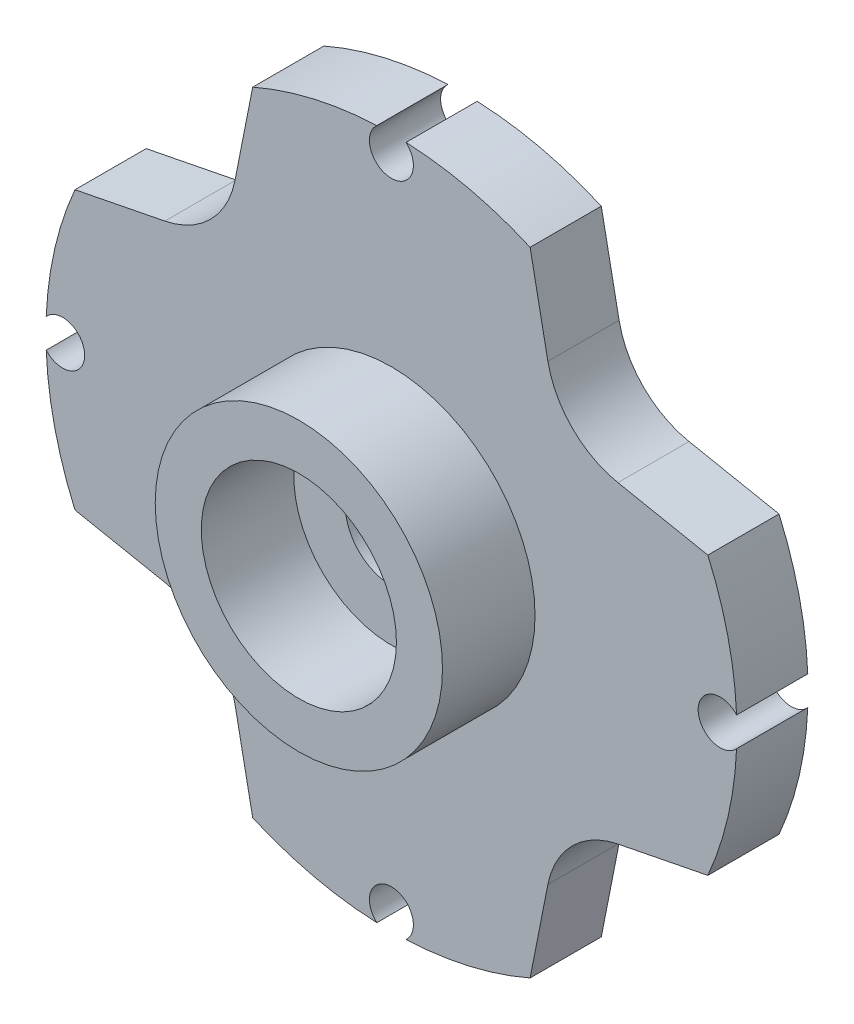
ISO-10303-21;
HEADER;
FILE_DESCRIPTION(('STEP AP214'),'2;1');
FILE_NAME('part.step','',(''),(''),'','','');
FILE_SCHEMA(('AUTOMOTIVE_DESIGN { 1 0 10303 214 1 1 1 1 }'));
ENDSEC;
DATA;
#1=APPLICATION_CONTEXT('core data for automotive mechanical design processes');
#2=APPLICATION_PROTOCOL_DEFINITION('international standard','automotive_design',2000,#1);
#3=PRODUCT_CONTEXT('',#1,'mechanical');
#4=PRODUCT('Part','Part','',(#3));
#5=PRODUCT_RELATED_PRODUCT_CATEGORY('part','',(#4));
#6=PRODUCT_DEFINITION_FORMATION('','',#4);
#7=PRODUCT_DEFINITION_CONTEXT('part definition',#1,'design');
#8=PRODUCT_DEFINITION('design','',#6,#7);
#9=PRODUCT_DEFINITION_SHAPE('','',#8);
#10=(LENGTH_UNIT() NAMED_UNIT(*) SI_UNIT(.MILLI.,.METRE.));
#11=(NAMED_UNIT(*) PLANE_ANGLE_UNIT() SI_UNIT($,.RADIAN.));
#12=(NAMED_UNIT(*) SI_UNIT($,.STERADIAN.) SOLID_ANGLE_UNIT());
#13=UNCERTAINTY_MEASURE_WITH_UNIT(LENGTH_MEASURE(1.E-05),#10,'distance_accuracy_value','');
#14=(GEOMETRIC_REPRESENTATION_CONTEXT(3) GLOBAL_UNCERTAINTY_ASSIGNED_CONTEXT((#13)) GLOBAL_UNIT_ASSIGNED_CONTEXT((#10,
#11,#12)) REPRESENTATION_CONTEXT('',''));
#15=CARTESIAN_POINT('',(0.,0.,0.));
#16=DIRECTION('',(0.,0.,1.));
#17=DIRECTION('',(1.,0.,0.));
#18=AXIS2_PLACEMENT_3D('',#15,#16,#17);
#19=CARTESIAN_POINT('',(-5.82133511095861,5.82133511095868,0.));
#20=DIRECTION('',(0.,0.,-1.));
#21=DIRECTION('',(-1.,0.,0.));
#22=AXIS2_PLACEMENT_3D('',#19,#20,#21);
#23=PLANE('',#22);
#24=CARTESIAN_POINT('',(0.,0.,0.));
#25=DIRECTION('',(0.,0.,-1.));
#26=DIRECTION('',(-1.,0.,0.));
#27=AXIS2_PLACEMENT_3D('',#24,#25,#26);
#28=CIRCLE('',#27,3.5);
#29=CARTESIAN_POINT('',(-3.5,0.,0.));
#30=VERTEX_POINT('',#29);
#31=EDGE_CURVE('E247',#30,#30,#28,.T.);
#32=ORIENTED_EDGE('',*,*,#31,.F.);
#33=EDGE_LOOP('',(#32));
#34=FACE_BOUND('',#33,.T.);
#35=CARTESIAN_POINT('',(-7.84999999999978,-1.67332814271504E-13,0.));
#36=DIRECTION('',(0.,0.,-1.));
#37=DIRECTION('',(-1.,0.,0.));
#38=AXIS2_PLACEMENT_3D('',#35,#36,#37);
#39=CIRCLE('',#38,0.525000000000361);
#40=CARTESIAN_POINT('',(-8.24263535031845,-0.34851467929002,0.));
#41=VERTEX_POINT('',#40);
#42=CARTESIAN_POINT('',(-8.24263535031847,0.348514679289669,0.));
#43=VERTEX_POINT('',#42);
#44=EDGE_CURVE('E207',#41,#43,#39,.F.);
#45=ORIENTED_EDGE('',*,*,#44,.T.);
#46=CARTESIAN_POINT('',(0.,0.,0.));
#47=DIRECTION('',(0.,0.,-1.));
#48=DIRECTION('',(-1.,0.,0.));
#49=AXIS2_PLACEMENT_3D('',#46,#47,#48);
#50=CIRCLE('',#49,8.25);
#51=CARTESIAN_POINT('',(-7.55593829753835,3.31214378368349,0.));
#52=VERTEX_POINT('',#51);
#53=EDGE_CURVE('E213',#43,#52,#50,.T.);
#54=ORIENTED_EDGE('',*,*,#53,.T.);
#55=DIRECTION('',(-0.981000863251907,-0.194003366720819,0.));
#56=VECTOR('',#55,1.);
#57=CARTESIAN_POINT('',(-5.40907795667691,3.73670827654834,0.));
#58=LINE('',#57,#56);
#59=CARTESIAN_POINT('',(-5.40907795667691,3.73670827654834,0.));
#60=VERTEX_POINT('',#59);
#61=EDGE_CURVE('E305',#60,#52,#58,.T.);
#62=ORIENTED_EDGE('',*,*,#61,.F.);
#63=CARTESIAN_POINT('',(-5.82133511095861,5.82133511095868,0.));
#64=DIRECTION('',(0.,0.,-1.));
#65=DIRECTION('',(-1.,0.,0.));
#66=AXIS2_PLACEMENT_3D('',#63,#64,#65);
#67=CIRCLE('',#66,2.125);
#68=CARTESIAN_POINT('',(-3.73670827654834,5.40907795667691,0.));
#69=VERTEX_POINT('',#68);
#70=EDGE_CURVE('E265',#69,#60,#67,.T.);
#71=ORIENTED_EDGE('',*,*,#70,.F.);
#72=DIRECTION('',(0.194003366720819,0.981000863251907,0.));
#73=VECTOR('',#72,1.);
#74=CARTESIAN_POINT('',(-3.73670827654834,5.40907795667691,0.));
#75=LINE('',#74,#73);
#76=CARTESIAN_POINT('',(-3.31214378368349,7.55593829753836,0.));
#77=VERTEX_POINT('',#76);
#78=EDGE_CURVE('E270',#69,#77,#75,.T.);
#79=ORIENTED_EDGE('',*,*,#78,.T.);
#80=CARTESIAN_POINT('',(-0.348514679289479,8.24263535031847,0.));
#81=VERTEX_POINT('',#80);
#82=EDGE_CURVE('E444',#77,#81,#50,.T.);
#83=ORIENTED_EDGE('',*,*,#82,.T.);
#84=CARTESIAN_POINT('',(0.,7.85,0.));
#85=DIRECTION('',(0.,0.,-1.));
#86=DIRECTION('',(-1.,0.,0.));
#87=AXIS2_PLACEMENT_3D('',#84,#85,#86);
#88=CIRCLE('',#87,0.525);
#89=CARTESIAN_POINT('',(0.3485146792896,8.24263535031847,0.));
#90=VERTEX_POINT('',#89);
#91=EDGE_CURVE('E232',#81,#90,#88,.F.);
#92=ORIENTED_EDGE('',*,*,#91,.T.);
#93=CARTESIAN_POINT('',(3.31214378368349,7.55593829753836,0.));
#94=VERTEX_POINT('',#93);
#95=EDGE_CURVE('E56',#90,#94,#50,.T.);
#96=ORIENTED_EDGE('',*,*,#95,.T.);
#97=DIRECTION('',(-0.194003366720819,0.981000863251907,0.));
#98=VECTOR('',#97,1.);
#99=CARTESIAN_POINT('',(3.73670827654834,5.40907795667691,0.));
#100=LINE('',#99,#98);
#101=CARTESIAN_POINT('',(3.73670827654835,5.40907795667691,0.));
#102=VERTEX_POINT('',#101);
#103=EDGE_CURVE('E328',#102,#94,#100,.T.);
#104=ORIENTED_EDGE('',*,*,#103,.F.);
#105=CARTESIAN_POINT('',(5.82133511095865,5.82133511095865,0.));
#106=DIRECTION('',(0.,0.,1.));
#107=DIRECTION('',(1.,0.,0.));
#108=AXIS2_PLACEMENT_3D('',#105,#106,#107);
#109=CIRCLE('',#108,2.125);
#110=CARTESIAN_POINT('',(5.40907795667692,3.73670827654835,0.));
#111=VERTEX_POINT('',#110);
#112=EDGE_CURVE('E325',#102,#111,#109,.T.);
#113=ORIENTED_EDGE('',*,*,#112,.T.);
#114=DIRECTION('',(0.981000863251908,-0.194003366720816,0.));
#115=VECTOR('',#114,1.);
#116=CARTESIAN_POINT('',(5.40907795667692,3.73670827654835,0.));
#117=LINE('',#116,#115);
#118=CARTESIAN_POINT('',(7.55593829753834,3.31214378368351,0.));
#119=VERTEX_POINT('',#118);
#120=EDGE_CURVE('E322',#111,#119,#117,.T.);
#121=ORIENTED_EDGE('',*,*,#120,.T.);
#122=CARTESIAN_POINT('',(8.24263535031844,0.348514679290255,0.));
#123=VERTEX_POINT('',#122);
#124=EDGE_CURVE('E460',#119,#123,#50,.T.);
#125=ORIENTED_EDGE('',*,*,#124,.T.);
#126=CARTESIAN_POINT('',(7.85000000000022,1.66371466534173E-13,0.));
#127=DIRECTION('',(0.,0.,-1.));
#128=DIRECTION('',(-1.,0.,0.));
#129=AXIS2_PLACEMENT_3D('',#126,#127,#128);
#130=CIRCLE('',#129,0.525000000000175);
#131=CARTESIAN_POINT('',(8.24263535031846,-0.348514679289906,0.));
#132=VERTEX_POINT('',#131);
#133=EDGE_CURVE('E226',#123,#132,#130,.F.);
#134=ORIENTED_EDGE('',*,*,#133,.T.);
#135=CARTESIAN_POINT('',(7.55593829753834,-3.31214378368351,0.));
#136=VERTEX_POINT('',#135);
#137=EDGE_CURVE('E448',#132,#136,#50,.T.);
#138=ORIENTED_EDGE('',*,*,#137,.T.);
#139=DIRECTION('',(0.981000863251908,0.194003366720816,0.));
#140=VECTOR('',#139,1.);
#141=CARTESIAN_POINT('',(5.40907795667692,-3.73670827654835,0.));
#142=LINE('',#141,#140);
#143=CARTESIAN_POINT('',(5.40907795667691,-3.73670827654835,0.));
#144=VERTEX_POINT('',#143);
#145=EDGE_CURVE('E319',#144,#136,#142,.T.);
#146=ORIENTED_EDGE('',*,*,#145,.F.);
#147=CARTESIAN_POINT('',(5.82133511095865,-5.82133511095865,0.));
#148=DIRECTION('',(0.,0.,-1.));
#149=DIRECTION('',(-1.,0.,0.));
#150=AXIS2_PLACEMENT_3D('',#147,#148,#149);
#151=CIRCLE('',#150,2.125);
#152=CARTESIAN_POINT('',(3.73670827654834,-5.40907795667691,0.));
#153=VERTEX_POINT('',#152);
#154=EDGE_CURVE('E317',#153,#144,#151,.T.);
#155=ORIENTED_EDGE('',*,*,#154,.F.);
#156=DIRECTION('',(-0.194003366720819,-0.981000863251907,0.));
#157=VECTOR('',#156,1.);
#158=CARTESIAN_POINT('',(3.73670827654834,-5.40907795667691,0.));
#159=LINE('',#158,#157);
#160=CARTESIAN_POINT('',(3.31214378368349,-7.55593829753836,0.));
#161=VERTEX_POINT('',#160);
#162=EDGE_CURVE('E314',#153,#161,#159,.T.);
#163=ORIENTED_EDGE('',*,*,#162,.T.);
#164=CARTESIAN_POINT('',(0.34851467929071,-8.24263535031842,0.));
#165=VERTEX_POINT('',#164);
#166=EDGE_CURVE('E473',#161,#165,#50,.T.);
#167=ORIENTED_EDGE('',*,*,#166,.T.);
#168=CARTESIAN_POINT('',(3.90352375159258E-13,-7.85,0.));
#169=DIRECTION('',(0.,0.,-1.));
#170=DIRECTION('',(-1.,0.,0.));
#171=AXIS2_PLACEMENT_3D('',#168,#169,#170);
#172=CIRCLE('',#171,0.525000000000481);
#173=CARTESIAN_POINT('',(-0.34851467928989,-8.24263535031846,0.));
#174=VERTEX_POINT('',#173);
#175=EDGE_CURVE('E219',#165,#174,#172,.F.);
#176=ORIENTED_EDGE('',*,*,#175,.T.);
#177=CARTESIAN_POINT('',(-3.31214378368349,-7.55593829753836,0.));
#178=VERTEX_POINT('',#177);
#179=EDGE_CURVE('E466',#174,#178,#50,.T.);
#180=ORIENTED_EDGE('',*,*,#179,.T.);
#181=DIRECTION('',(0.194003366720819,-0.981000863251907,0.));
#182=VECTOR('',#181,1.);
#183=CARTESIAN_POINT('',(-3.73670827654834,-5.40907795667691,0.));
#184=LINE('',#183,#182);
#185=CARTESIAN_POINT('',(-3.73670827654832,-5.4090779566769,0.));
#186=VERTEX_POINT('',#185);
#187=EDGE_CURVE('E311',#186,#178,#184,.T.);
#188=ORIENTED_EDGE('',*,*,#187,.F.);
#189=CARTESIAN_POINT('',(-5.82133511095861,-5.82133511095868,0.));
#190=DIRECTION('',(0.,0.,1.));
#191=DIRECTION('',(1.,0.,0.));
#192=AXIS2_PLACEMENT_3D('',#189,#190,#191);
#193=CIRCLE('',#192,2.125);
#194=CARTESIAN_POINT('',(-5.40907795667691,-3.73670827654834,0.));
#195=VERTEX_POINT('',#194);
#196=EDGE_CURVE('E309',#186,#195,#193,.T.);
#197=ORIENTED_EDGE('',*,*,#196,.T.);
#198=DIRECTION('',(-0.981000863251907,0.194003366720819,0.));
#199=VECTOR('',#198,1.);
#200=CARTESIAN_POINT('',(-5.40907795667691,-3.73670827654834,0.));
#201=LINE('',#200,#199);
#202=CARTESIAN_POINT('',(-7.55593829753835,-3.31214378368349,0.));
#203=VERTEX_POINT('',#202);
#204=EDGE_CURVE('E210',#195,#203,#201,.T.);
#205=ORIENTED_EDGE('',*,*,#204,.T.);
#206=EDGE_CURVE('E194',#203,#41,#50,.T.);
#207=ORIENTED_EDGE('',*,*,#206,.T.);
#208=EDGE_LOOP('',(#45,#54,#62,#71,#79,#83,#92,#96,#104,#113,#121,#125,#134,#138,#146,#155,#163,
#167,#176,#180,#188,#197,#205,#207));
#209=FACE_BOUND('',#208,.T.);
#210=ADVANCED_FACE('F33',(#34,#209),#23,.T.);
#211=CARTESIAN_POINT('',(-5.82133511095861,5.82133511095868,1.7));
#212=DIRECTION('',(0.,0.,-1.));
#213=DIRECTION('',(-1.,0.,0.));
#214=AXIS2_PLACEMENT_3D('',#211,#212,#213);
#215=PLANE('',#214);
#216=CARTESIAN_POINT('',(0.,0.,1.7));
#217=DIRECTION('',(0.,0.,-1.));
#218=DIRECTION('',(-1.,0.,0.));
#219=AXIS2_PLACEMENT_3D('',#216,#217,#218);
#220=CIRCLE('',#219,3.43);
#221=CARTESIAN_POINT('',(-3.43,0.,1.7));
#222=VERTEX_POINT('',#221);
#223=EDGE_CURVE('E202',#222,#222,#220,.F.);
#224=ORIENTED_EDGE('',*,*,#223,.F.);
#225=EDGE_LOOP('',(#224));
#226=FACE_BOUND('',#225,.T.);
#227=CARTESIAN_POINT('',(0.,0.,1.7));
#228=DIRECTION('',(0.,0.,-1.));
#229=DIRECTION('',(-1.,0.,0.));
#230=AXIS2_PLACEMENT_3D('',#227,#228,#229);
#231=CIRCLE('',#230,8.25);
#232=CARTESIAN_POINT('',(-8.24263535031847,0.348514679289669,1.7));
#233=VERTEX_POINT('',#232);
#234=CARTESIAN_POINT('',(-7.55593829753835,3.31214378368349,1.7));
#235=VERTEX_POINT('',#234);
#236=EDGE_CURVE('E434',#233,#235,#231,.T.);
#237=ORIENTED_EDGE('',*,*,#236,.F.);
#238=CARTESIAN_POINT('',(-7.84999999999978,-1.67332814271504E-13,1.7));
#239=DIRECTION('',(0.,0.,1.));
#240=DIRECTION('',(1.,0.,0.));
#241=AXIS2_PLACEMENT_3D('',#238,#239,#240);
#242=CIRCLE('',#241,0.525000000000361);
#243=CARTESIAN_POINT('',(-8.24263535031845,-0.34851467929002,1.7));
#244=VERTEX_POINT('',#243);
#245=EDGE_CURVE('E216',#244,#233,#242,.T.);
#246=ORIENTED_EDGE('',*,*,#245,.F.);
#247=CARTESIAN_POINT('',(-7.55593829753835,-3.31214378368349,1.7));
#248=VERTEX_POINT('',#247);
#249=EDGE_CURVE('E197',#248,#244,#231,.T.);
#250=ORIENTED_EDGE('',*,*,#249,.F.);
#251=DIRECTION('',(-0.981000863251907,0.194003366720819,0.));
#252=VECTOR('',#251,1.);
#253=CARTESIAN_POINT('',(-5.40907795667691,-3.73670827654834,1.7));
#254=LINE('',#253,#252);
#255=CARTESIAN_POINT('',(-5.40907795667691,-3.73670827654834,1.7));
#256=VERTEX_POINT('',#255);
#257=EDGE_CURVE('E273',#256,#248,#254,.T.);
#258=ORIENTED_EDGE('',*,*,#257,.F.);
#259=CARTESIAN_POINT('',(-5.82133511095861,-5.82133511095868,1.7));
#260=DIRECTION('',(0.,0.,1.));
#261=DIRECTION('',(1.,0.,0.));
#262=AXIS2_PLACEMENT_3D('',#259,#260,#261);
#263=CIRCLE('',#262,2.125);
#264=CARTESIAN_POINT('',(-3.73670827654832,-5.4090779566769,1.7));
#265=VERTEX_POINT('',#264);
#266=EDGE_CURVE('E276',#265,#256,#263,.T.);
#267=ORIENTED_EDGE('',*,*,#266,.F.);
#268=DIRECTION('',(0.194003366720819,-0.981000863251907,0.));
#269=VECTOR('',#268,1.);
#270=CARTESIAN_POINT('',(-3.73670827654834,-5.40907795667691,1.7));
#271=LINE('',#270,#269);
#272=CARTESIAN_POINT('',(-3.31214378368349,-7.55593829753836,1.7));
#273=VERTEX_POINT('',#272);
#274=EDGE_CURVE('E279',#265,#273,#271,.T.);
#275=ORIENTED_EDGE('',*,*,#274,.T.);
#276=CARTESIAN_POINT('',(-0.34851467928989,-8.24263535031846,1.7));
#277=VERTEX_POINT('',#276);
#278=EDGE_CURVE('E469',#277,#273,#231,.T.);
#279=ORIENTED_EDGE('',*,*,#278,.F.);
#280=CARTESIAN_POINT('',(3.90352375159258E-13,-7.85,1.7));
#281=DIRECTION('',(0.,0.,1.));
#282=DIRECTION('',(1.,0.,0.));
#283=AXIS2_PLACEMENT_3D('',#280,#281,#282);
#284=CIRCLE('',#283,0.525000000000481);
#285=CARTESIAN_POINT('',(0.34851467929071,-8.24263535031842,1.7));
#286=VERTEX_POINT('',#285);
#287=EDGE_CURVE('E223',#286,#277,#284,.T.);
#288=ORIENTED_EDGE('',*,*,#287,.F.);
#289=CARTESIAN_POINT('',(3.31214378368349,-7.55593829753836,1.7));
#290=VERTEX_POINT('',#289);
#291=EDGE_CURVE('E474',#290,#286,#231,.T.);
#292=ORIENTED_EDGE('',*,*,#291,.F.);
#293=DIRECTION('',(-0.194003366720819,-0.981000863251907,0.));
#294=VECTOR('',#293,1.);
#295=CARTESIAN_POINT('',(3.73670827654834,-5.40907795667691,1.7));
#296=LINE('',#295,#294);
#297=CARTESIAN_POINT('',(3.73670827654834,-5.40907795667691,1.7));
#298=VERTEX_POINT('',#297);
#299=EDGE_CURVE('E282',#298,#290,#296,.T.);
#300=ORIENTED_EDGE('',*,*,#299,.F.);
#301=CARTESIAN_POINT('',(5.82133511095865,-5.82133511095865,1.7));
#302=DIRECTION('',(0.,0.,-1.));
#303=DIRECTION('',(-1.,0.,0.));
#304=AXIS2_PLACEMENT_3D('',#301,#302,#303);
#305=CIRCLE('',#304,2.125);
#306=CARTESIAN_POINT('',(5.40907795667691,-3.73670827654835,1.7));
#307=VERTEX_POINT('',#306);
#308=EDGE_CURVE('E285',#298,#307,#305,.T.);
#309=ORIENTED_EDGE('',*,*,#308,.T.);
#310=DIRECTION('',(0.981000863251908,0.194003366720816,0.));
#311=VECTOR('',#310,1.);
#312=CARTESIAN_POINT('',(5.40907795667692,-3.73670827654835,1.7));
#313=LINE('',#312,#311);
#314=CARTESIAN_POINT('',(7.55593829753834,-3.31214378368351,1.7));
#315=VERTEX_POINT('',#314);
#316=EDGE_CURVE('E287',#307,#315,#313,.T.);
#317=ORIENTED_EDGE('',*,*,#316,.T.);
#318=CARTESIAN_POINT('',(8.24263535031846,-0.348514679289906,1.7));
#319=VERTEX_POINT('',#318);
#320=EDGE_CURVE('E456',#319,#315,#231,.T.);
#321=ORIENTED_EDGE('',*,*,#320,.F.);
#322=CARTESIAN_POINT('',(7.85000000000022,1.66371466534173E-13,1.7));
#323=DIRECTION('',(0.,0.,1.));
#324=DIRECTION('',(1.,0.,0.));
#325=AXIS2_PLACEMENT_3D('',#322,#323,#324);
#326=CIRCLE('',#325,0.525000000000175);
#327=CARTESIAN_POINT('',(8.24263535031844,0.348514679290255,1.7));
#328=VERTEX_POINT('',#327);
#329=EDGE_CURVE('E229',#328,#319,#326,.T.);
#330=ORIENTED_EDGE('',*,*,#329,.F.);
#331=CARTESIAN_POINT('',(7.55593829753834,3.31214378368351,1.7));
#332=VERTEX_POINT('',#331);
#333=EDGE_CURVE('E463',#332,#328,#231,.T.);
#334=ORIENTED_EDGE('',*,*,#333,.F.);
#335=DIRECTION('',(0.981000863251908,-0.194003366720816,0.));
#336=VECTOR('',#335,1.);
#337=CARTESIAN_POINT('',(5.40907795667692,3.73670827654835,1.7));
#338=LINE('',#337,#336);
#339=CARTESIAN_POINT('',(5.40907795667692,3.73670827654835,1.7));
#340=VERTEX_POINT('',#339);
#341=EDGE_CURVE('E290',#340,#332,#338,.T.);
#342=ORIENTED_EDGE('',*,*,#341,.F.);
#343=CARTESIAN_POINT('',(5.82133511095865,5.82133511095865,1.7));
#344=DIRECTION('',(0.,0.,1.));
#345=DIRECTION('',(1.,0.,0.));
#346=AXIS2_PLACEMENT_3D('',#343,#344,#345);
#347=CIRCLE('',#346,2.125);
#348=CARTESIAN_POINT('',(3.73670827654835,5.40907795667691,1.7));
#349=VERTEX_POINT('',#348);
#350=EDGE_CURVE('E293',#349,#340,#347,.T.);
#351=ORIENTED_EDGE('',*,*,#350,.F.);
#352=DIRECTION('',(-0.194003366720819,0.981000863251907,0.));
#353=VECTOR('',#352,1.);
#354=CARTESIAN_POINT('',(3.73670827654834,5.40907795667691,1.7));
#355=LINE('',#354,#353);
#356=CARTESIAN_POINT('',(3.31214378368349,7.55593829753836,1.7));
#357=VERTEX_POINT('',#356);
#358=EDGE_CURVE('E296',#349,#357,#355,.T.);
#359=ORIENTED_EDGE('',*,*,#358,.T.);
#360=CARTESIAN_POINT('',(0.348514679289599,8.24263535031847,1.7));
#361=VERTEX_POINT('',#360);
#362=EDGE_CURVE('E446',#361,#357,#231,.T.);
#363=ORIENTED_EDGE('',*,*,#362,.F.);
#364=CARTESIAN_POINT('',(0.,7.85,1.7));
#365=DIRECTION('',(0.,0.,1.));
#366=DIRECTION('',(1.,0.,0.));
#367=AXIS2_PLACEMENT_3D('',#364,#365,#366);
#368=CIRCLE('',#367,0.525);
#369=CARTESIAN_POINT('',(-0.348514679289479,8.24263535031847,1.7));
#370=VERTEX_POINT('',#369);
#371=EDGE_CURVE('E235',#370,#361,#368,.T.);
#372=ORIENTED_EDGE('',*,*,#371,.F.);
#373=CARTESIAN_POINT('',(-3.31214378368349,7.55593829753836,1.7));
#374=VERTEX_POINT('',#373);
#375=EDGE_CURVE('E48',#374,#370,#231,.T.);
#376=ORIENTED_EDGE('',*,*,#375,.F.);
#377=DIRECTION('',(0.194003366720819,0.981000863251907,0.));
#378=VECTOR('',#377,1.);
#379=CARTESIAN_POINT('',(-3.73670827654834,5.40907795667691,1.7));
#380=LINE('',#379,#378);
#381=CARTESIAN_POINT('',(-3.73670827654834,5.40907795667691,1.7));
#382=VERTEX_POINT('',#381);
#383=EDGE_CURVE('E299',#382,#374,#380,.T.);
#384=ORIENTED_EDGE('',*,*,#383,.F.);
#385=CARTESIAN_POINT('',(-5.82133511095861,5.82133511095868,1.7));
#386=DIRECTION('',(0.,0.,-1.));
#387=DIRECTION('',(-1.,0.,0.));
#388=AXIS2_PLACEMENT_3D('',#385,#386,#387);
#389=CIRCLE('',#388,2.125);
#390=CARTESIAN_POINT('',(-5.40907795667691,3.73670827654834,1.7));
#391=VERTEX_POINT('',#390);
#392=EDGE_CURVE('E266',#382,#391,#389,.T.);
#393=ORIENTED_EDGE('',*,*,#392,.T.);
#394=DIRECTION('',(-0.981000863251907,-0.194003366720819,0.));
#395=VECTOR('',#394,1.);
#396=CARTESIAN_POINT('',(-5.40907795667691,3.73670827654834,1.7));
#397=LINE('',#396,#395);
#398=EDGE_CURVE('E269',#391,#235,#397,.T.);
#399=ORIENTED_EDGE('',*,*,#398,.T.);
#400=EDGE_LOOP('',(#237,#246,#250,#258,#267,#275,#279,#288,#292,#300,#309,#317,#321,#330,#334,
#342,#351,#359,#363,#372,#376,#384,#393,#399));
#401=FACE_BOUND('',#400,.T.);
#402=ADVANCED_FACE('F372',(#226,#401),#215,.F.);
#403=CARTESIAN_POINT('',(-5.40907795667691,3.73670827654834,1.7));
#404=DIRECTION('',(0.194003366720819,-0.981000863251907,0.));
#405=DIRECTION('',(0.981000863251907,0.194003366720819,0.));
#406=AXIS2_PLACEMENT_3D('',#403,#404,#405);
#407=PLANE('',#406);
#408=DIRECTION('',(0.,0.,1.));
#409=VECTOR('',#408,1.);
#410=CARTESIAN_POINT('',(-7.55593829753835,3.31214378368349,-0.51));
#411=LINE('',#410,#409);
#412=EDGE_CURVE('E428',#235,#52,#411,.F.);
#413=ORIENTED_EDGE('',*,*,#412,.F.);
#414=ORIENTED_EDGE('',*,*,#398,.F.);
#415=DIRECTION('',(0.,0.,-1.));
#416=VECTOR('',#415,1.);
#417=CARTESIAN_POINT('',(-5.40907795667691,3.73670827654834,1.7));
#418=LINE('',#417,#416);
#419=EDGE_CURVE('E347',#391,#60,#418,.T.);
#420=ORIENTED_EDGE('',*,*,#419,.T.);
#421=ORIENTED_EDGE('',*,*,#61,.T.);
#422=EDGE_LOOP('',(#413,#414,#420,#421));
#423=FACE_BOUND('',#422,.T.);
#424=ADVANCED_FACE('F379',(#423),#407,.F.);
#425=CARTESIAN_POINT('',(-5.40907795667691,-3.73670827654834,1.7));
#426=DIRECTION('',(-0.194003366720819,-0.981000863251907,0.));
#427=DIRECTION('',(0.981000863251907,-0.194003366720819,0.));
#428=AXIS2_PLACEMENT_3D('',#425,#426,#427);
#429=PLANE('',#428);
#430=ORIENTED_EDGE('',*,*,#257,.T.);
#431=DIRECTION('',(0.,0.,1.));
#432=VECTOR('',#431,1.);
#433=CARTESIAN_POINT('',(-7.55593829753835,-3.31214378368349,-0.51));
#434=LINE('',#433,#432);
#435=EDGE_CURVE('E211',#248,#203,#434,.F.);
#436=ORIENTED_EDGE('',*,*,#435,.T.);
#437=ORIENTED_EDGE('',*,*,#204,.F.);
#438=DIRECTION('',(0.,0.,-1.));
#439=VECTOR('',#438,1.);
#440=CARTESIAN_POINT('',(-5.40907795667691,-3.73670827654834,1.7));
#441=LINE('',#440,#439);
#442=EDGE_CURVE('E345',#256,#195,#441,.T.);
#443=ORIENTED_EDGE('',*,*,#442,.F.);
#444=EDGE_LOOP('',(#430,#436,#437,#443));
#445=FACE_BOUND('',#444,.T.);
#446=ADVANCED_FACE('F416',(#445),#429,.T.);
#447=CARTESIAN_POINT('',(-3.73670827654834,-5.40907795667691,1.7));
#448=DIRECTION('',(0.981000863251907,0.194003366720819,0.));
#449=DIRECTION('',(-0.194003366720819,0.981000863251907,0.));
#450=AXIS2_PLACEMENT_3D('',#447,#448,#449);
#451=PLANE('',#450);
#452=DIRECTION('',(0.,0.,1.));
#453=VECTOR('',#452,1.);
#454=CARTESIAN_POINT('',(-3.31214378368349,-7.55593829753836,-0.51));
#455=LINE('',#454,#453);
#456=EDGE_CURVE('E464',#273,#178,#455,.F.);
#457=ORIENTED_EDGE('',*,*,#456,.F.);
#458=ORIENTED_EDGE('',*,*,#274,.F.);
#459=DIRECTION('',(0.,0.,-1.));
#460=VECTOR('',#459,1.);
#461=CARTESIAN_POINT('',(-3.73670827654832,-5.4090779566769,1.7));
#462=LINE('',#461,#460);
#463=EDGE_CURVE('E343',#265,#186,#462,.T.);
#464=ORIENTED_EDGE('',*,*,#463,.T.);
#465=ORIENTED_EDGE('',*,*,#187,.T.);
#466=EDGE_LOOP('',(#457,#458,#464,#465));
#467=FACE_BOUND('',#466,.T.);
#468=ADVANCED_FACE('F412',(#467),#451,.F.);
#469=CARTESIAN_POINT('',(3.73670827654834,-5.40907795667691,1.7));
#470=DIRECTION('',(0.981000863251907,-0.194003366720819,0.));
#471=DIRECTION('',(0.194003366720819,0.981000863251907,0.));
#472=AXIS2_PLACEMENT_3D('',#469,#470,#471);
#473=PLANE('',#472);
#474=ORIENTED_EDGE('',*,*,#299,.T.);
#475=DIRECTION('',(0.,0.,1.));
#476=VECTOR('',#475,1.);
#477=CARTESIAN_POINT('',(3.31214378368349,-7.55593829753836,-0.51));
#478=LINE('',#477,#476);
#479=EDGE_CURVE('E470',#290,#161,#478,.F.);
#480=ORIENTED_EDGE('',*,*,#479,.T.);
#481=ORIENTED_EDGE('',*,*,#162,.F.);
#482=DIRECTION('',(0.,0.,-1.));
#483=VECTOR('',#482,1.);
#484=CARTESIAN_POINT('',(3.73670827654834,-5.40907795667691,1.7));
#485=LINE('',#484,#483);
#486=EDGE_CURVE('E341',#298,#153,#485,.T.);
#487=ORIENTED_EDGE('',*,*,#486,.F.);
#488=EDGE_LOOP('',(#474,#480,#481,#487));
#489=FACE_BOUND('',#488,.T.);
#490=ADVANCED_FACE('F405',(#489),#473,.T.);
#491=CARTESIAN_POINT('',(5.40907795667692,-3.73670827654835,1.7));
#492=DIRECTION('',(-0.194003366720816,0.981000863251908,0.));
#493=DIRECTION('',(-0.981000863251908,-0.194003366720816,0.));
#494=AXIS2_PLACEMENT_3D('',#491,#492,#493);
#495=PLANE('',#494);
#496=DIRECTION('',(0.,0.,1.));
#497=VECTOR('',#496,1.);
#498=CARTESIAN_POINT('',(7.55593829753834,-3.31214378368351,-0.51));
#499=LINE('',#498,#497);
#500=EDGE_CURVE('E452',#315,#136,#499,.F.);
#501=ORIENTED_EDGE('',*,*,#500,.F.);
#502=ORIENTED_EDGE('',*,*,#316,.F.);
#503=DIRECTION('',(0.,0.,-1.));
#504=VECTOR('',#503,1.);
#505=CARTESIAN_POINT('',(5.40907795667691,-3.73670827654835,1.7));
#506=LINE('',#505,#504);
#507=EDGE_CURVE('E338',#307,#144,#506,.T.);
#508=ORIENTED_EDGE('',*,*,#507,.T.);
#509=ORIENTED_EDGE('',*,*,#145,.T.);
#510=EDGE_LOOP('',(#501,#502,#508,#509));
#511=FACE_BOUND('',#510,.T.);
#512=ADVANCED_FACE('F401',(#511),#495,.F.);
#513=CARTESIAN_POINT('',(5.40907795667692,3.73670827654835,1.7));
#514=DIRECTION('',(0.194003366720816,0.981000863251908,0.));
#515=DIRECTION('',(-0.981000863251908,0.194003366720816,0.));
#516=AXIS2_PLACEMENT_3D('',#513,#514,#515);
#517=PLANE('',#516);
#518=ORIENTED_EDGE('',*,*,#341,.T.);
#519=DIRECTION('',(0.,0.,1.));
#520=VECTOR('',#519,1.);
#521=CARTESIAN_POINT('',(7.55593829753834,3.31214378368351,-0.51));
#522=LINE('',#521,#520);
#523=EDGE_CURVE('E457',#332,#119,#522,.F.);
#524=ORIENTED_EDGE('',*,*,#523,.T.);
#525=ORIENTED_EDGE('',*,*,#120,.F.);
#526=DIRECTION('',(0.,0.,-1.));
#527=VECTOR('',#526,1.);
#528=CARTESIAN_POINT('',(5.40907795667692,3.73670827654835,1.7));
#529=LINE('',#528,#527);
#530=EDGE_CURVE('E336',#340,#111,#529,.T.);
#531=ORIENTED_EDGE('',*,*,#530,.F.);
#532=EDGE_LOOP('',(#518,#524,#525,#531));
#533=FACE_BOUND('',#532,.T.);
#534=ADVANCED_FACE('F392',(#533),#517,.T.);
#535=CARTESIAN_POINT('',(3.73670827654834,5.40907795667691,1.7));
#536=DIRECTION('',(-0.981000863251907,-0.194003366720819,0.));
#537=DIRECTION('',(0.194003366720819,-0.981000863251907,0.));
#538=AXIS2_PLACEMENT_3D('',#535,#536,#537);
#539=PLANE('',#538);
#540=DIRECTION('',(0.,0.,1.));
#541=VECTOR('',#540,1.);
#542=CARTESIAN_POINT('',(3.31214378368349,7.55593829753836,-0.51));
#543=LINE('',#542,#541);
#544=EDGE_CURVE('E217',#357,#94,#543,.F.);
#545=ORIENTED_EDGE('',*,*,#544,.F.);
#546=ORIENTED_EDGE('',*,*,#358,.F.);
#547=DIRECTION('',(0.,0.,-1.));
#548=VECTOR('',#547,1.);
#549=CARTESIAN_POINT('',(3.73670827654835,5.40907795667691,1.7));
#550=LINE('',#549,#548);
#551=EDGE_CURVE('E334',#349,#102,#550,.T.);
#552=ORIENTED_EDGE('',*,*,#551,.T.);
#553=ORIENTED_EDGE('',*,*,#103,.T.);
#554=EDGE_LOOP('',(#545,#546,#552,#553));
#555=FACE_BOUND('',#554,.T.);
#556=ADVANCED_FACE('F388',(#555),#539,.F.);
#557=CARTESIAN_POINT('',(-3.73670827654834,5.40907795667691,1.7));
#558=DIRECTION('',(-0.981000863251907,0.194003366720819,0.));
#559=DIRECTION('',(-0.194003366720819,-0.981000863251907,0.));
#560=AXIS2_PLACEMENT_3D('',#557,#558,#559);
#561=PLANE('',#560);
#562=ORIENTED_EDGE('',*,*,#383,.T.);
#563=DIRECTION('',(0.,0.,1.));
#564=VECTOR('',#563,1.);
#565=CARTESIAN_POINT('',(-3.31214378368349,7.55593829753836,-0.51));
#566=LINE('',#565,#564);
#567=EDGE_CURVE('E442',#374,#77,#566,.F.);
#568=ORIENTED_EDGE('',*,*,#567,.T.);
#569=ORIENTED_EDGE('',*,*,#78,.F.);
#570=DIRECTION('',(0.,0.,-1.));
#571=VECTOR('',#570,1.);
#572=CARTESIAN_POINT('',(-3.73670827654834,5.40907795667691,1.7));
#573=LINE('',#572,#571);
#574=EDGE_CURVE('E302',#382,#69,#573,.T.);
#575=ORIENTED_EDGE('',*,*,#574,.F.);
#576=EDGE_LOOP('',(#562,#568,#569,#575));
#577=FACE_BOUND('',#576,.T.);
#578=ADVANCED_FACE('F384',(#577),#561,.T.);
#579=CARTESIAN_POINT('',(0.,7.85,-0.511));
#580=DIRECTION('',(0.,0.,1.));
#581=DIRECTION('',(1.,0.,0.));
#582=AXIS2_PLACEMENT_3D('',#579,#580,#581);
#583=CYLINDRICAL_SURFACE('',#582,0.525);
#584=DIRECTION('',(0.,0.,1.));
#585=VECTOR('',#584,1.);
#586=CARTESIAN_POINT('',(0.348514679289599,8.24263535031847,1.7));
#587=LINE('',#586,#585);
#588=EDGE_CURVE('E443',#90,#361,#587,.T.);
#589=ORIENTED_EDGE('',*,*,#588,.F.);
#590=ORIENTED_EDGE('',*,*,#91,.F.);
#591=DIRECTION('',(0.,0.,1.));
#592=VECTOR('',#591,1.);
#593=CARTESIAN_POINT('',(-0.348514679289479,8.24263535031847,1.7));
#594=LINE('',#593,#592);
#595=EDGE_CURVE('E450',#370,#81,#594,.F.);
#596=ORIENTED_EDGE('',*,*,#595,.F.);
#597=ORIENTED_EDGE('',*,*,#371,.T.);
#598=EDGE_LOOP('',(#589,#590,#596,#597));
#599=FACE_BOUND('',#598,.T.);
#600=ADVANCED_FACE('F387',(#599),#583,.F.);
#601=CARTESIAN_POINT('',(7.85000000000022,1.66371466534173E-13,-0.511));
#602=DIRECTION('',(0.,0.,1.));
#603=DIRECTION('',(1.,0.,0.));
#604=AXIS2_PLACEMENT_3D('',#601,#602,#603);
#605=CYLINDRICAL_SURFACE('',#604,0.525000000000175);
#606=DIRECTION('',(0.,0.,1.));
#607=VECTOR('',#606,1.);
#608=CARTESIAN_POINT('',(8.24263535031846,-0.348514679289906,1.7));
#609=LINE('',#608,#607);
#610=EDGE_CURVE('E454',#132,#319,#609,.T.);
#611=ORIENTED_EDGE('',*,*,#610,.F.);
#612=ORIENTED_EDGE('',*,*,#133,.F.);
#613=DIRECTION('',(0.,0.,1.));
#614=VECTOR('',#613,1.);
#615=CARTESIAN_POINT('',(8.24263535031844,0.348514679290255,1.7));
#616=LINE('',#615,#614);
#617=EDGE_CURVE('E461',#328,#123,#616,.F.);
#618=ORIENTED_EDGE('',*,*,#617,.F.);
#619=ORIENTED_EDGE('',*,*,#329,.T.);
#620=EDGE_LOOP('',(#611,#612,#618,#619));
#621=FACE_BOUND('',#620,.T.);
#622=ADVANCED_FACE('F574',(#621),#605,.F.);
#623=CARTESIAN_POINT('',(3.90352375159258E-13,-7.85,-0.511));
#624=DIRECTION('',(0.,0.,1.));
#625=DIRECTION('',(1.,0.,0.));
#626=AXIS2_PLACEMENT_3D('',#623,#624,#625);
#627=CYLINDRICAL_SURFACE('',#626,0.525000000000481);
#628=DIRECTION('',(0.,0.,1.));
#629=VECTOR('',#628,1.);
#630=CARTESIAN_POINT('',(-0.34851467928989,-8.24263535031846,1.7));
#631=LINE('',#630,#629);
#632=EDGE_CURVE('E467',#174,#277,#631,.T.);
#633=ORIENTED_EDGE('',*,*,#632,.F.);
#634=ORIENTED_EDGE('',*,*,#175,.F.);
#635=DIRECTION('',(0.,0.,1.));
#636=VECTOR('',#635,1.);
#637=CARTESIAN_POINT('',(0.34851467929071,-8.24263535031842,1.7));
#638=LINE('',#637,#636);
#639=EDGE_CURVE('E430',#286,#165,#638,.F.);
#640=ORIENTED_EDGE('',*,*,#639,.F.);
#641=ORIENTED_EDGE('',*,*,#287,.T.);
#642=EDGE_LOOP('',(#633,#634,#640,#641));
#643=FACE_BOUND('',#642,.T.);
#644=ADVANCED_FACE('F367',(#643),#627,.F.);
#645=CARTESIAN_POINT('',(-7.84999999999978,-1.67332814271504E-13,-0.511));
#646=DIRECTION('',(0.,0.,1.));
#647=DIRECTION('',(1.,0.,0.));
#648=AXIS2_PLACEMENT_3D('',#645,#646,#647);
#649=CYLINDRICAL_SURFACE('',#648,0.525000000000361);
#650=DIRECTION('',(0.,0.,1.));
#651=VECTOR('',#650,1.);
#652=CARTESIAN_POINT('',(-8.24263535031847,0.348514679289669,1.7));
#653=LINE('',#652,#651);
#654=EDGE_CURVE('E11',#43,#233,#653,.T.);
#655=ORIENTED_EDGE('',*,*,#654,.F.);
#656=ORIENTED_EDGE('',*,*,#44,.F.);
#657=DIRECTION('',(0.,0.,1.));
#658=VECTOR('',#657,1.);
#659=CARTESIAN_POINT('',(-8.24263535031845,-0.34851467929002,1.7));
#660=LINE('',#659,#658);
#661=EDGE_CURVE('E41',#244,#41,#660,.F.);
#662=ORIENTED_EDGE('',*,*,#661,.F.);
#663=ORIENTED_EDGE('',*,*,#245,.T.);
#664=EDGE_LOOP('',(#655,#656,#662,#663));
#665=FACE_BOUND('',#664,.T.);
#666=ADVANCED_FACE('F215',(#665),#649,.F.);
#667=CARTESIAN_POINT('',(0.,0.,-0.000999999999999916));
#668=DIRECTION('',(0.,0.,1.));
#669=DIRECTION('',(1.,0.,0.));
#670=AXIS2_PLACEMENT_3D('',#667,#668,#669);
#671=CYLINDRICAL_SURFACE('',#670,1.1);
#672=CARTESIAN_POINT('',(0.,0.,1.7));
#673=DIRECTION('',(0.,0.,1.));
#674=DIRECTION('',(1.,0.,0.));
#675=AXIS2_PLACEMENT_3D('',#672,#673,#674);
#676=CIRCLE('',#675,1.1);
#677=CARTESIAN_POINT('',(1.1,0.,1.7));
#678=VERTEX_POINT('',#677);
#679=EDGE_CURVE('E262',#678,#678,#676,.T.);
#680=ORIENTED_EDGE('',*,*,#679,.T.);
#681=EDGE_LOOP('',(#680));
#682=FACE_BOUND('',#681,.T.);
#683=CARTESIAN_POINT('',(0.,0.,0.59));
#684=DIRECTION('',(0.,0.,-1.));
#685=DIRECTION('',(-1.,0.,0.));
#686=AXIS2_PLACEMENT_3D('',#683,#684,#685);
#687=CIRCLE('',#686,1.1);
#688=CARTESIAN_POINT('',(-1.1,0.,0.59));
#689=VERTEX_POINT('',#688);
#690=EDGE_CURVE('E243',#689,#689,#687,.F.);
#691=ORIENTED_EDGE('',*,*,#690,.F.);
#692=EDGE_LOOP('',(#691));
#693=FACE_BOUND('',#692,.T.);
#694=ADVANCED_FACE('F357',(#682,#693),#671,.F.);
#695=CARTESIAN_POINT('',(-5.82133511095861,5.82133511095868,1.7));
#696=DIRECTION('',(0.,0.,-1.));
#697=DIRECTION('',(-1.,0.,0.));
#698=AXIS2_PLACEMENT_3D('',#695,#696,#697);
#699=CYLINDRICAL_SURFACE('',#698,2.125);
#700=ORIENTED_EDGE('',*,*,#70,.T.);
#701=ORIENTED_EDGE('',*,*,#419,.F.);
#702=ORIENTED_EDGE('',*,*,#392,.F.);
#703=ORIENTED_EDGE('',*,*,#574,.T.);
#704=EDGE_LOOP('',(#700,#701,#702,#703));
#705=FACE_BOUND('',#704,.T.);
#706=ADVANCED_FACE('F35',(#705),#699,.F.);
#707=CARTESIAN_POINT('',(-5.82133511095861,-5.82133511095868,1.7));
#708=DIRECTION('',(0.,0.,-1.));
#709=DIRECTION('',(-1.,0.,0.));
#710=AXIS2_PLACEMENT_3D('',#707,#708,#709);
#711=CYLINDRICAL_SURFACE('',#710,2.125);
#712=ORIENTED_EDGE('',*,*,#196,.F.);
#713=ORIENTED_EDGE('',*,*,#463,.F.);
#714=ORIENTED_EDGE('',*,*,#266,.T.);
#715=ORIENTED_EDGE('',*,*,#442,.T.);
#716=EDGE_LOOP('',(#712,#713,#714,#715));
#717=FACE_BOUND('',#716,.T.);
#718=ADVANCED_FACE('F364',(#717),#711,.F.);
#719=CARTESIAN_POINT('',(5.82133511095865,-5.82133511095865,1.7));
#720=DIRECTION('',(0.,0.,-1.));
#721=DIRECTION('',(-1.,0.,0.));
#722=AXIS2_PLACEMENT_3D('',#719,#720,#721);
#723=CYLINDRICAL_SURFACE('',#722,2.125);
#724=ORIENTED_EDGE('',*,*,#154,.T.);
#725=ORIENTED_EDGE('',*,*,#507,.F.);
#726=ORIENTED_EDGE('',*,*,#308,.F.);
#727=ORIENTED_EDGE('',*,*,#486,.T.);
#728=EDGE_LOOP('',(#724,#725,#726,#727));
#729=FACE_BOUND('',#728,.T.);
#730=ADVANCED_FACE('F397',(#729),#723,.F.);
#731=CARTESIAN_POINT('',(5.82133511095865,5.82133511095865,1.7));
#732=DIRECTION('',(0.,0.,-1.));
#733=DIRECTION('',(-1.,0.,0.));
#734=AXIS2_PLACEMENT_3D('',#731,#732,#733);
#735=CYLINDRICAL_SURFACE('',#734,2.125);
#736=ORIENTED_EDGE('',*,*,#112,.F.);
#737=ORIENTED_EDGE('',*,*,#551,.F.);
#738=ORIENTED_EDGE('',*,*,#350,.T.);
#739=ORIENTED_EDGE('',*,*,#530,.T.);
#740=EDGE_LOOP('',(#736,#737,#738,#739));
#741=FACE_BOUND('',#740,.T.);
#742=ADVANCED_FACE('F394',(#741),#735,.F.);
#743=CARTESIAN_POINT('',(0.,0.,1.7));
#744=DIRECTION('',(0.,0.,1.));
#745=DIRECTION('',(1.,0.,0.));
#746=AXIS2_PLACEMENT_3D('',#743,#744,#745);
#747=CIRCLE('',#746,2.33);
#748=CARTESIAN_POINT('',(2.33,0.,1.7));
#749=VERTEX_POINT('',#748);
#750=EDGE_CURVE('E251',#749,#749,#747,.T.);
#751=ORIENTED_EDGE('',*,*,#750,.T.);
#752=EDGE_LOOP('',(#751));
#753=FACE_BOUND('',#752,.T.);
#754=ORIENTED_EDGE('',*,*,#679,.F.);
#755=EDGE_LOOP('',(#754));
#756=FACE_BOUND('',#755,.T.);
#757=ADVANCED_FACE('F381',(#753,#756),#215,.F.);
#758=CARTESIAN_POINT('',(0.,0.,3.91));
#759=DIRECTION('',(0.,0.,1.));
#760=DIRECTION('',(1.,0.,0.));
#761=AXIS2_PLACEMENT_3D('',#758,#759,#760);
#762=PLANE('',#761);
#763=CARTESIAN_POINT('',(0.,0.,3.91));
#764=DIRECTION('',(0.,0.,1.));
#765=DIRECTION('',(1.,0.,0.));
#766=AXIS2_PLACEMENT_3D('',#763,#764,#765);
#767=CIRCLE('',#766,3.43);
#768=CARTESIAN_POINT('',(3.43,0.,3.91));
#769=VERTEX_POINT('',#768);
#770=EDGE_CURVE('E257',#769,#769,#767,.T.);
#771=ORIENTED_EDGE('',*,*,#770,.T.);
#772=EDGE_LOOP('',(#771));
#773=FACE_BOUND('',#772,.T.);
#774=CARTESIAN_POINT('',(0.,0.,3.91));
#775=DIRECTION('',(0.,0.,1.));
#776=DIRECTION('',(1.,0.,0.));
#777=AXIS2_PLACEMENT_3D('',#774,#775,#776);
#778=CIRCLE('',#777,2.33);
#779=CARTESIAN_POINT('',(2.33,0.,3.91));
#780=VERTEX_POINT('',#779);
#781=EDGE_CURVE('E254',#780,#780,#778,.T.);
#782=ORIENTED_EDGE('',*,*,#781,.F.);
#783=EDGE_LOOP('',(#782));
#784=FACE_BOUND('',#783,.T.);
#785=ADVANCED_FACE('F695',(#773,#784),#762,.T.);
#786=CARTESIAN_POINT('',(0.,0.,3.91));
#787=DIRECTION('',(0.,0.,-1.));
#788=DIRECTION('',(-1.,0.,0.));
#789=AXIS2_PLACEMENT_3D('',#786,#787,#788);
#790=CYLINDRICAL_SURFACE('',#789,3.43);
#791=ORIENTED_EDGE('',*,*,#770,.F.);
#792=EDGE_LOOP('',(#791));
#793=FACE_BOUND('',#792,.T.);
#794=ORIENTED_EDGE('',*,*,#223,.T.);
#795=EDGE_LOOP('',(#794));
#796=FACE_BOUND('',#795,.T.);
#797=ADVANCED_FACE('F687',(#793,#796),#790,.T.);
#798=CARTESIAN_POINT('',(0.,0.,3.91));
#799=DIRECTION('',(0.,0.,-1.));
#800=DIRECTION('',(-1.,0.,0.));
#801=AXIS2_PLACEMENT_3D('',#798,#799,#800);
#802=CYLINDRICAL_SURFACE('',#801,2.33);
#803=ORIENTED_EDGE('',*,*,#781,.T.);
#804=EDGE_LOOP('',(#803));
#805=FACE_BOUND('',#804,.T.);
#806=ORIENTED_EDGE('',*,*,#750,.F.);
#807=EDGE_LOOP('',(#806));
#808=FACE_BOUND('',#807,.T.);
#809=ADVANCED_FACE('F679',(#805,#808),#802,.F.);
#810=CARTESIAN_POINT('',(0.,0.,-0.51));
#811=DIRECTION('',(0.,0.,-1.));
#812=DIRECTION('',(-1.,0.,0.));
#813=AXIS2_PLACEMENT_3D('',#810,#811,#812);
#814=PLANE('',#813);
#815=CARTESIAN_POINT('',(0.,0.,-0.51));
#816=DIRECTION('',(0.,0.,-1.));
#817=DIRECTION('',(-1.,0.,0.));
#818=AXIS2_PLACEMENT_3D('',#815,#816,#817);
#819=CIRCLE('',#818,3.5);
#820=CARTESIAN_POINT('',(-3.5,0.,-0.51));
#821=VERTEX_POINT('',#820);
#822=EDGE_CURVE('E248',#821,#821,#819,.T.);
#823=ORIENTED_EDGE('',*,*,#822,.T.);
#824=EDGE_LOOP('',(#823));
#825=FACE_BOUND('',#824,.T.);
#826=CARTESIAN_POINT('',(0.,0.,-0.51));
#827=DIRECTION('',(0.,0.,-1.));
#828=DIRECTION('',(-1.,0.,0.));
#829=AXIS2_PLACEMENT_3D('',#826,#827,#828);
#830=CIRCLE('',#829,2.95);
#831=CARTESIAN_POINT('',(-2.95,0.,-0.51));
#832=VERTEX_POINT('',#831);
#833=EDGE_CURVE('E244',#832,#832,#830,.T.);
#834=ORIENTED_EDGE('',*,*,#833,.F.);
#835=EDGE_LOOP('',(#834));
#836=FACE_BOUND('',#835,.T.);
#837=ADVANCED_FACE('F671',(#825,#836),#814,.T.);
#838=CARTESIAN_POINT('',(0.,0.,-0.51));
#839=DIRECTION('',(0.,0.,1.));
#840=DIRECTION('',(1.,0.,0.));
#841=AXIS2_PLACEMENT_3D('',#838,#839,#840);
#842=CYLINDRICAL_SURFACE('',#841,3.5);
#843=ORIENTED_EDGE('',*,*,#822,.F.);
#844=EDGE_LOOP('',(#843));
#845=FACE_BOUND('',#844,.T.);
#846=ORIENTED_EDGE('',*,*,#31,.T.);
#847=EDGE_LOOP('',(#846));
#848=FACE_BOUND('',#847,.T.);
#849=ADVANCED_FACE('F663',(#845,#848),#842,.T.);
#850=CARTESIAN_POINT('',(0.,0.,-0.51));
#851=DIRECTION('',(0.,0.,1.));
#852=DIRECTION('',(1.,0.,0.));
#853=AXIS2_PLACEMENT_3D('',#850,#851,#852);
#854=CYLINDRICAL_SURFACE('',#853,2.95);
#855=ORIENTED_EDGE('',*,*,#833,.T.);
#856=EDGE_LOOP('',(#855));
#857=FACE_BOUND('',#856,.T.);
#858=CARTESIAN_POINT('',(0.,0.,0.59));
#859=DIRECTION('',(0.,0.,-1.));
#860=DIRECTION('',(-1.,0.,0.));
#861=AXIS2_PLACEMENT_3D('',#858,#859,#860);
#862=CIRCLE('',#861,2.95);
#863=CARTESIAN_POINT('',(-2.95,0.,0.59));
#864=VERTEX_POINT('',#863);
#865=EDGE_CURVE('E238',#864,#864,#862,.T.);
#866=ORIENTED_EDGE('',*,*,#865,.F.);
#867=EDGE_LOOP('',(#866));
#868=FACE_BOUND('',#867,.T.);
#869=ADVANCED_FACE('F656',(#857,#868),#854,.F.);
#870=CARTESIAN_POINT('',(0.,0.,0.59));
#871=DIRECTION('',(0.,0.,-1.));
#872=DIRECTION('',(-1.,0.,0.));
#873=AXIS2_PLACEMENT_3D('',#870,#871,#872);
#874=PLANE('',#873);
#875=ORIENTED_EDGE('',*,*,#865,.T.);
#876=EDGE_LOOP('',(#875));
#877=FACE_BOUND('',#876,.T.);
#878=ORIENTED_EDGE('',*,*,#690,.T.);
#879=EDGE_LOOP('',(#878));
#880=FACE_BOUND('',#879,.T.);
#881=ADVANCED_FACE('F355',(#877,#880),#874,.T.);
#882=CARTESIAN_POINT('',(0.,0.,-0.51));
#883=DIRECTION('',(0.,0.,1.));
#884=DIRECTION('',(1.,0.,0.));
#885=AXIS2_PLACEMENT_3D('',#882,#883,#884);
#886=CYLINDRICAL_SURFACE('',#885,8.25);
#887=ORIENTED_EDGE('',*,*,#249,.T.);
#888=ORIENTED_EDGE('',*,*,#661,.T.);
#889=ORIENTED_EDGE('',*,*,#206,.F.);
#890=ORIENTED_EDGE('',*,*,#435,.F.);
#891=EDGE_LOOP('',(#887,#888,#889,#890));
#892=FACE_BOUND('',#891,.T.);
#893=ADVANCED_FACE('F193',(#892),#886,.T.);
#894=ORIENTED_EDGE('',*,*,#412,.T.);
#895=ORIENTED_EDGE('',*,*,#53,.F.);
#896=ORIENTED_EDGE('',*,*,#654,.T.);
#897=ORIENTED_EDGE('',*,*,#236,.T.);
#898=EDGE_LOOP('',(#894,#895,#896,#897));
#899=FACE_BOUND('',#898,.T.);
#900=ADVANCED_FACE('F522',(#899),#886,.T.);
#901=ORIENTED_EDGE('',*,*,#291,.T.);
#902=ORIENTED_EDGE('',*,*,#639,.T.);
#903=ORIENTED_EDGE('',*,*,#166,.F.);
#904=ORIENTED_EDGE('',*,*,#479,.F.);
#905=EDGE_LOOP('',(#901,#902,#903,#904));
#906=FACE_BOUND('',#905,.T.);
#907=ADVANCED_FACE('F502',(#906),#886,.T.);
#908=ORIENTED_EDGE('',*,*,#456,.T.);
#909=ORIENTED_EDGE('',*,*,#179,.F.);
#910=ORIENTED_EDGE('',*,*,#632,.T.);
#911=ORIENTED_EDGE('',*,*,#278,.T.);
#912=EDGE_LOOP('',(#908,#909,#910,#911));
#913=FACE_BOUND('',#912,.T.);
#914=ADVANCED_FACE('F512',(#913),#886,.T.);
#915=ORIENTED_EDGE('',*,*,#333,.T.);
#916=ORIENTED_EDGE('',*,*,#617,.T.);
#917=ORIENTED_EDGE('',*,*,#124,.F.);
#918=ORIENTED_EDGE('',*,*,#523,.F.);
#919=EDGE_LOOP('',(#915,#916,#917,#918));
#920=FACE_BOUND('',#919,.T.);
#921=ADVANCED_FACE('F514',(#920),#886,.T.);
#922=ORIENTED_EDGE('',*,*,#500,.T.);
#923=ORIENTED_EDGE('',*,*,#137,.F.);
#924=ORIENTED_EDGE('',*,*,#610,.T.);
#925=ORIENTED_EDGE('',*,*,#320,.T.);
#926=EDGE_LOOP('',(#922,#923,#924,#925));
#927=FACE_BOUND('',#926,.T.);
#928=ADVANCED_FACE('F521',(#927),#886,.T.);
#929=ORIENTED_EDGE('',*,*,#375,.T.);
#930=ORIENTED_EDGE('',*,*,#595,.T.);
#931=ORIENTED_EDGE('',*,*,#82,.F.);
#932=ORIENTED_EDGE('',*,*,#567,.F.);
#933=EDGE_LOOP('',(#929,#930,#931,#932));
#934=FACE_BOUND('',#933,.T.);
#935=ADVANCED_FACE('F516',(#934),#886,.T.);
#936=ORIENTED_EDGE('',*,*,#544,.T.);
#937=ORIENTED_EDGE('',*,*,#95,.F.);
#938=ORIENTED_EDGE('',*,*,#588,.T.);
#939=ORIENTED_EDGE('',*,*,#362,.T.);
#940=EDGE_LOOP('',(#936,#937,#938,#939));
#941=FACE_BOUND('',#940,.T.);
#942=ADVANCED_FACE('F524',(#941),#886,.T.);
#943=CLOSED_SHELL('',(#210,#402,#424,#446,#468,#490,#512,#534,#556,#578,#600,#622,#644,#666,
#694,#706,#718,#730,#742,#757,#785,#797,#809,#837,#849,#869,#881,#893,#900,#907,#914,#921,#928,
#935,#942));
#944=MANIFOLD_SOLID_BREP('B2',#943);
#945=ADVANCED_BREP_SHAPE_REPRESENTATION('',(#18,#944),#14);
#946=SHAPE_DEFINITION_REPRESENTATION(#9,#945);
ENDSEC;
END-ISO-10303-21;
